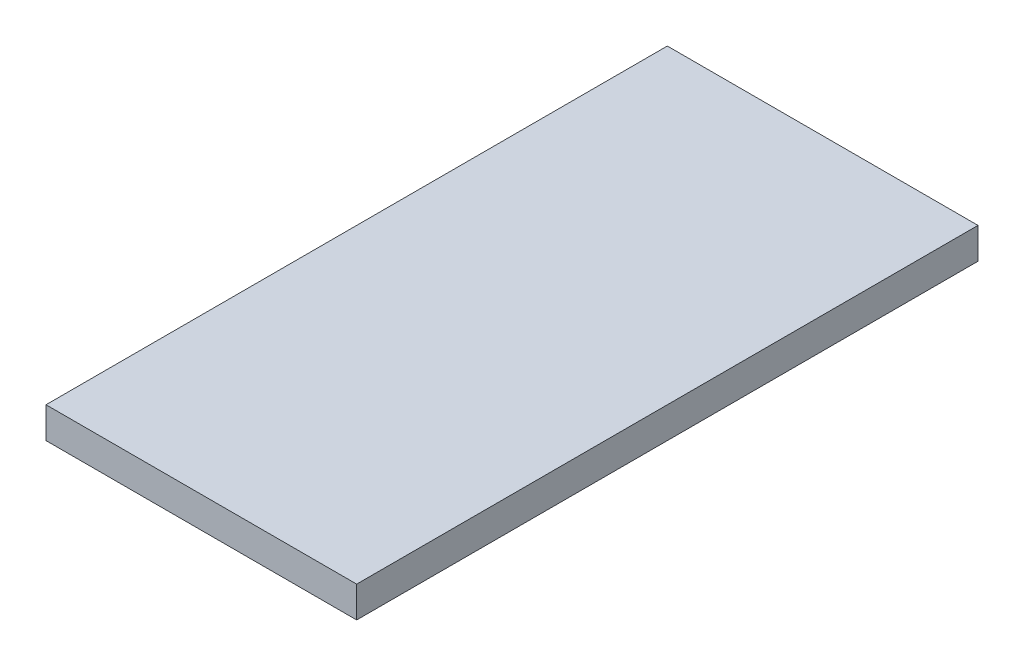
ISO-10303-21;
HEADER;
FILE_DESCRIPTION(('STEP AP214'),'2;1');
FILE_NAME('part.step','',(''),(''),'','','');
FILE_SCHEMA(('AUTOMOTIVE_DESIGN { 1 0 10303 214 1 1 1 1 }'));
ENDSEC;
DATA;
#1=APPLICATION_CONTEXT('core data for automotive mechanical design processes');
#2=APPLICATION_PROTOCOL_DEFINITION('international standard','automotive_design',2000,#1);
#3=PRODUCT_CONTEXT('',#1,'mechanical');
#4=PRODUCT('Part','Part','',(#3));
#5=PRODUCT_RELATED_PRODUCT_CATEGORY('part','',(#4));
#6=PRODUCT_DEFINITION_FORMATION('','',#4);
#7=PRODUCT_DEFINITION_CONTEXT('part definition',#1,'design');
#8=PRODUCT_DEFINITION('design','',#6,#7);
#9=PRODUCT_DEFINITION_SHAPE('','',#8);
#10=(LENGTH_UNIT() NAMED_UNIT(*) SI_UNIT(.MILLI.,.METRE.));
#11=(NAMED_UNIT(*) PLANE_ANGLE_UNIT() SI_UNIT($,.RADIAN.));
#12=(NAMED_UNIT(*) SI_UNIT($,.STERADIAN.) SOLID_ANGLE_UNIT());
#13=UNCERTAINTY_MEASURE_WITH_UNIT(LENGTH_MEASURE(1.E-05),#10,'distance_accuracy_value','');
#14=(GEOMETRIC_REPRESENTATION_CONTEXT(3) GLOBAL_UNCERTAINTY_ASSIGNED_CONTEXT((#13)) GLOBAL_UNIT_ASSIGNED_CONTEXT((#10,
#11,#12)) REPRESENTATION_CONTEXT('',''));
#15=CARTESIAN_POINT('',(0.,0.,0.));
#16=DIRECTION('',(0.,0.,1.));
#17=DIRECTION('',(1.,0.,0.));
#18=AXIS2_PLACEMENT_3D('',#15,#16,#17);
#19=CARTESIAN_POINT('',(31.75,3.175,63.5));
#20=DIRECTION('',(-1.,0.,0.));
#21=DIRECTION('',(0.,0.,1.));
#22=AXIS2_PLACEMENT_3D('',#19,#20,#21);
#23=PLANE('',#22);
#24=DIRECTION('',(0.,0.,-1.));
#25=VECTOR('',#24,1.);
#26=CARTESIAN_POINT('',(31.75,-3.175,63.5));
#27=LINE('',#26,#25);
#28=CARTESIAN_POINT('',(31.75,-3.175,63.5));
#29=VERTEX_POINT('',#28);
#30=CARTESIAN_POINT('',(31.75,-3.175,-63.5));
#31=VERTEX_POINT('',#30);
#32=EDGE_CURVE('E94',#29,#31,#27,.T.);
#33=ORIENTED_EDGE('',*,*,#32,.T.);
#34=DIRECTION('',(0.,-1.,0.));
#35=VECTOR('',#34,1.);
#36=CARTESIAN_POINT('',(31.75,3.175,-63.5));
#37=LINE('',#36,#35);
#38=CARTESIAN_POINT('',(31.75,3.175,-63.5));
#39=VERTEX_POINT('',#38);
#40=EDGE_CURVE('E11',#39,#31,#37,.T.);
#41=ORIENTED_EDGE('',*,*,#40,.F.);
#42=DIRECTION('',(0.,0.,-1.));
#43=VECTOR('',#42,1.);
#44=CARTESIAN_POINT('',(31.75,3.175,63.5));
#45=LINE('',#44,#43);
#46=CARTESIAN_POINT('',(31.75,3.175,63.5));
#47=VERTEX_POINT('',#46);
#48=EDGE_CURVE('E103',#47,#39,#45,.T.);
#49=ORIENTED_EDGE('',*,*,#48,.F.);
#50=DIRECTION('',(0.,-1.,0.));
#51=VECTOR('',#50,1.);
#52=CARTESIAN_POINT('',(31.75,3.175,63.5));
#53=LINE('',#52,#51);
#54=EDGE_CURVE('E108',#47,#29,#53,.T.);
#55=ORIENTED_EDGE('',*,*,#54,.T.);
#56=EDGE_LOOP('',(#33,#41,#49,#55));
#57=FACE_BOUND('',#56,.T.);
#58=ADVANCED_FACE('F33',(#57),#23,.F.);
#59=CARTESIAN_POINT('',(-31.75,3.175,-63.5));
#60=DIRECTION('',(0.,0.,1.));
#61=DIRECTION('',(1.,0.,0.));
#62=AXIS2_PLACEMENT_3D('',#59,#60,#61);
#63=PLANE('',#62);
#64=DIRECTION('',(-1.,0.,0.));
#65=VECTOR('',#64,1.);
#66=CARTESIAN_POINT('',(-31.75,-3.175,-63.5));
#67=LINE('',#66,#65);
#68=CARTESIAN_POINT('',(-31.75,-3.175,-63.5));
#69=VERTEX_POINT('',#68);
#70=EDGE_CURVE('E98',#31,#69,#67,.T.);
#71=ORIENTED_EDGE('',*,*,#70,.T.);
#72=DIRECTION('',(0.,-1.,0.));
#73=VECTOR('',#72,1.);
#74=CARTESIAN_POINT('',(-31.75,3.175,-63.5));
#75=LINE('',#74,#73);
#76=CARTESIAN_POINT('',(-31.75,3.175,-63.5));
#77=VERTEX_POINT('',#76);
#78=EDGE_CURVE('E41',#77,#69,#75,.T.);
#79=ORIENTED_EDGE('',*,*,#78,.F.);
#80=DIRECTION('',(-1.,0.,0.));
#81=VECTOR('',#80,1.);
#82=CARTESIAN_POINT('',(-31.75,3.175,-63.5));
#83=LINE('',#82,#81);
#84=EDGE_CURVE('E80',#39,#77,#83,.T.);
#85=ORIENTED_EDGE('',*,*,#84,.F.);
#86=ORIENTED_EDGE('',*,*,#40,.T.);
#87=EDGE_LOOP('',(#71,#79,#85,#86));
#88=FACE_BOUND('',#87,.T.);
#89=ADVANCED_FACE('F131',(#88),#63,.F.);
#90=CARTESIAN_POINT('',(-31.75,3.175,63.5));
#91=DIRECTION('',(1.,0.,0.));
#92=DIRECTION('',(0.,0.,-1.));
#93=AXIS2_PLACEMENT_3D('',#90,#91,#92);
#94=PLANE('',#93);
#95=CARTESIAN_POINT('',(-31.75,0.,-22.225));
#96=DIRECTION('',(-1.,0.,0.));
#97=DIRECTION('',(0.,0.,1.));
#98=AXIS2_PLACEMENT_3D('',#95,#96,#97);
#99=CIRCLE('',#98,0.888999999999989);
#100=CARTESIAN_POINT('',(-31.75,0.,-21.336));
#101=VERTEX_POINT('',#100);
#102=EDGE_CURVE('E95',#101,#101,#99,.T.);
#103=ORIENTED_EDGE('',*,*,#102,.F.);
#104=EDGE_LOOP('',(#103));
#105=FACE_BOUND('',#104,.T.);
#106=DIRECTION('',(0.,0.,1.));
#107=VECTOR('',#106,1.);
#108=CARTESIAN_POINT('',(-31.75,-3.175,63.5));
#109=LINE('',#108,#107);
#110=CARTESIAN_POINT('',(-31.75,-3.175,63.5));
#111=VERTEX_POINT('',#110);
#112=EDGE_CURVE('E67',#69,#111,#109,.T.);
#113=ORIENTED_EDGE('',*,*,#112,.T.);
#114=DIRECTION('',(0.,-1.,0.));
#115=VECTOR('',#114,1.);
#116=CARTESIAN_POINT('',(-31.75,3.175,63.5));
#117=LINE('',#116,#115);
#118=CARTESIAN_POINT('',(-31.75,3.175,63.5));
#119=VERTEX_POINT('',#118);
#120=EDGE_CURVE('E114',#119,#111,#117,.T.);
#121=ORIENTED_EDGE('',*,*,#120,.F.);
#122=DIRECTION('',(0.,0.,1.));
#123=VECTOR('',#122,1.);
#124=CARTESIAN_POINT('',(-31.75,3.175,63.5));
#125=LINE('',#124,#123);
#126=EDGE_CURVE('E106',#77,#119,#125,.T.);
#127=ORIENTED_EDGE('',*,*,#126,.F.);
#128=ORIENTED_EDGE('',*,*,#78,.T.);
#129=EDGE_LOOP('',(#113,#121,#127,#128));
#130=FACE_BOUND('',#129,.T.);
#131=ADVANCED_FACE('F116',(#105,#130),#94,.F.);
#132=CARTESIAN_POINT('',(-31.75,3.175,63.5));
#133=DIRECTION('',(0.,0.,-1.));
#134=DIRECTION('',(-1.,0.,0.));
#135=AXIS2_PLACEMENT_3D('',#132,#133,#134);
#136=PLANE('',#135);
#137=DIRECTION('',(1.,0.,0.));
#138=VECTOR('',#137,1.);
#139=CARTESIAN_POINT('',(-31.75,-3.175,63.5));
#140=LINE('',#139,#138);
#141=EDGE_CURVE('E73',#111,#29,#140,.T.);
#142=ORIENTED_EDGE('',*,*,#141,.T.);
#143=ORIENTED_EDGE('',*,*,#54,.F.);
#144=DIRECTION('',(1.,0.,0.));
#145=VECTOR('',#144,1.);
#146=CARTESIAN_POINT('',(-31.75,3.175,63.5));
#147=LINE('',#146,#145);
#148=EDGE_CURVE('E49',#119,#47,#147,.T.);
#149=ORIENTED_EDGE('',*,*,#148,.F.);
#150=ORIENTED_EDGE('',*,*,#120,.T.);
#151=EDGE_LOOP('',(#142,#143,#149,#150));
#152=FACE_BOUND('',#151,.T.);
#153=ADVANCED_FACE('F122',(#152),#136,.F.);
#154=CARTESIAN_POINT('',(31.75,3.175,-63.5));
#155=DIRECTION('',(0.,-1.,0.));
#156=DIRECTION('',(0.,0.,-1.));
#157=AXIS2_PLACEMENT_3D('',#154,#155,#156);
#158=PLANE('',#157);
#159=ORIENTED_EDGE('',*,*,#48,.T.);
#160=ORIENTED_EDGE('',*,*,#84,.T.);
#161=ORIENTED_EDGE('',*,*,#126,.T.);
#162=ORIENTED_EDGE('',*,*,#148,.T.);
#163=EDGE_LOOP('',(#159,#160,#161,#162));
#164=FACE_BOUND('',#163,.T.);
#165=ADVANCED_FACE('F124',(#164),#158,.F.);
#166=CARTESIAN_POINT('',(31.75,-3.175,-63.5));
#167=DIRECTION('',(0.,-1.,0.));
#168=DIRECTION('',(0.,0.,-1.));
#169=AXIS2_PLACEMENT_3D('',#166,#167,#168);
#170=PLANE('',#169);
#171=ORIENTED_EDGE('',*,*,#32,.F.);
#172=ORIENTED_EDGE('',*,*,#141,.F.);
#173=ORIENTED_EDGE('',*,*,#112,.F.);
#174=ORIENTED_EDGE('',*,*,#70,.F.);
#175=EDGE_LOOP('',(#171,#172,#173,#174));
#176=FACE_BOUND('',#175,.T.);
#177=ADVANCED_FACE('F88',(#176),#170,.T.);
#178=CARTESIAN_POINT('',(-26.162,0.,-22.225));
#179=DIRECTION('',(-1.,0.,0.));
#180=DIRECTION('',(0.,0.,1.));
#181=AXIS2_PLACEMENT_3D('',#178,#179,#180);
#182=CONICAL_SURFACE('',#181,0.888999999999987,1.02974425867665);
#183=CARTESIAN_POINT('',(-25.6278349096845,0.,-22.225));
#184=VERTEX_POINT('',#183);
#185=VERTEX_LOOP('',#184);
#186=FACE_BOUND('',#185,.T.);
#187=CARTESIAN_POINT('',(-26.162,0.,-22.225));
#188=DIRECTION('',(-1.,0.,0.));
#189=DIRECTION('',(0.,0.,1.));
#190=AXIS2_PLACEMENT_3D('',#187,#188,#189);
#191=CIRCLE('',#190,0.888999999999987);
#192=CARTESIAN_POINT('',(-26.162,0.,-21.336));
#193=VERTEX_POINT('',#192);
#194=EDGE_CURVE('E92',#193,#193,#191,.T.);
#195=ORIENTED_EDGE('',*,*,#194,.T.);
#196=EDGE_LOOP('',(#195));
#197=FACE_BOUND('',#196,.T.);
#198=ADVANCED_FACE('F84',(#186,#197),#182,.F.);
#199=CARTESIAN_POINT('',(-31.75,0.,-22.225));
#200=DIRECTION('',(-1.,0.,0.));
#201=DIRECTION('',(0.,0.,1.));
#202=AXIS2_PLACEMENT_3D('',#199,#200,#201);
#203=CYLINDRICAL_SURFACE('',#202,0.888999999999988);
#204=ORIENTED_EDGE('',*,*,#194,.F.);
#205=EDGE_LOOP('',(#204));
#206=FACE_BOUND('',#205,.T.);
#207=ORIENTED_EDGE('',*,*,#102,.T.);
#208=EDGE_LOOP('',(#207));
#209=FACE_BOUND('',#208,.T.);
#210=ADVANCED_FACE('F87',(#206,#209),#203,.F.);
#211=CLOSED_SHELL('',(#58,#89,#131,#153,#165,#177,#198,#210));
#212=MANIFOLD_SOLID_BREP('B2',#211);
#213=ADVANCED_BREP_SHAPE_REPRESENTATION('',(#18,#212),#14);
#214=SHAPE_DEFINITION_REPRESENTATION(#9,#213);
ENDSEC;
END-ISO-10303-21;
